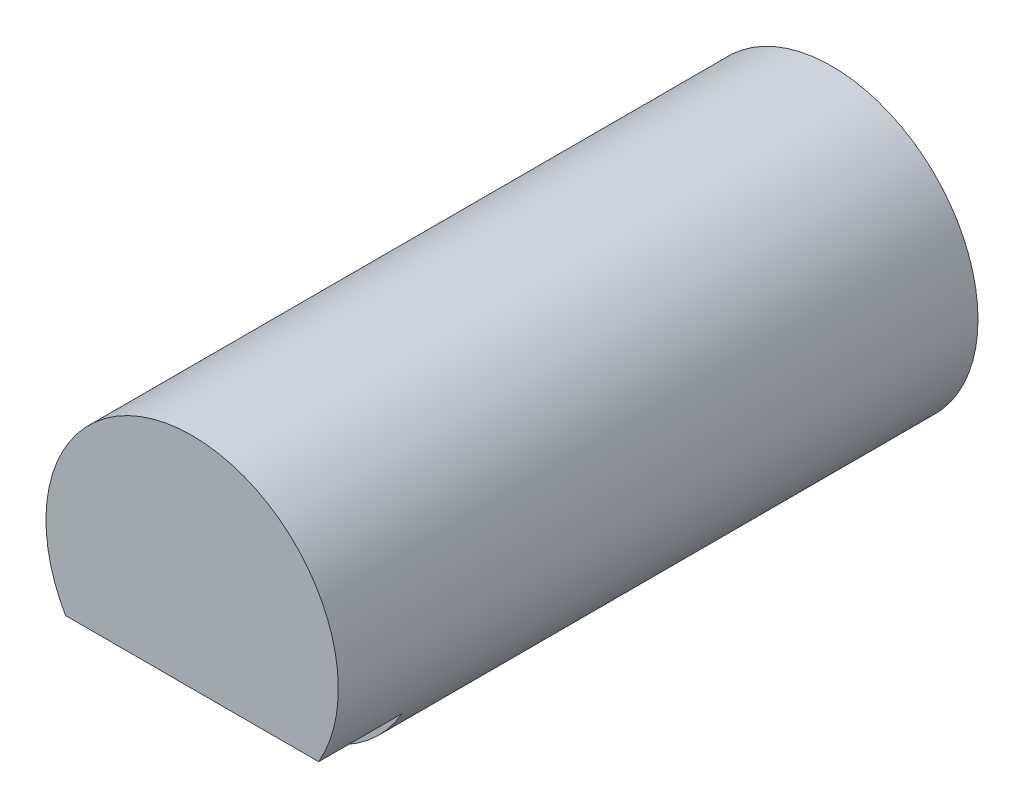
ISO-10303-21;
HEADER;
FILE_DESCRIPTION(('STEP AP214'),'2;1');
FILE_NAME('part.step','',(''),(''),'','','');
FILE_SCHEMA(('AUTOMOTIVE_DESIGN { 1 0 10303 214 1 1 1 1 }'));
ENDSEC;
DATA;
#1=APPLICATION_CONTEXT('core data for automotive mechanical design processes');
#2=APPLICATION_PROTOCOL_DEFINITION('international standard','automotive_design',2000,#1);
#3=PRODUCT_CONTEXT('',#1,'mechanical');
#4=PRODUCT('Part','Part','',(#3));
#5=PRODUCT_RELATED_PRODUCT_CATEGORY('part','',(#4));
#6=PRODUCT_DEFINITION_FORMATION('','',#4);
#7=PRODUCT_DEFINITION_CONTEXT('part definition',#1,'design');
#8=PRODUCT_DEFINITION('design','',#6,#7);
#9=PRODUCT_DEFINITION_SHAPE('','',#8);
#10=(LENGTH_UNIT() NAMED_UNIT(*) SI_UNIT(.MILLI.,.METRE.));
#11=(NAMED_UNIT(*) PLANE_ANGLE_UNIT() SI_UNIT($,.RADIAN.));
#12=(NAMED_UNIT(*) SI_UNIT($,.STERADIAN.) SOLID_ANGLE_UNIT());
#13=UNCERTAINTY_MEASURE_WITH_UNIT(LENGTH_MEASURE(1.E-05),#10,'distance_accuracy_value','');
#14=(GEOMETRIC_REPRESENTATION_CONTEXT(3) GLOBAL_UNCERTAINTY_ASSIGNED_CONTEXT((#13)) GLOBAL_UNIT_ASSIGNED_CONTEXT((#10,
#11,#12)) REPRESENTATION_CONTEXT('',''));
#15=CARTESIAN_POINT('',(0.,0.,0.));
#16=DIRECTION('',(0.,0.,1.));
#17=DIRECTION('',(1.,0.,0.));
#18=AXIS2_PLACEMENT_3D('',#15,#16,#17);
#19=CARTESIAN_POINT('',(-166.361835022894,44.9023235191993,22.552));
#20=DIRECTION('',(0.,0.,1.));
#21=DIRECTION('',(1.,0.,0.));
#22=AXIS2_PLACEMENT_3D('',#19,#20,#21);
#23=PLANE('',#22);
#24=CARTESIAN_POINT('',(-166.361835022894,44.9023235191993,22.552));
#25=DIRECTION('',(0.,0.,1.));
#26=DIRECTION('',(1.,0.,0.));
#27=AXIS2_PLACEMENT_3D('',#24,#25,#26);
#28=CIRCLE('',#27,5.92666666666668);
#29=CARTESIAN_POINT('',(-171.49447891599,41.938990185866,22.552));
#30=VERTEX_POINT('',#29);
#31=CARTESIAN_POINT('',(-161.229191129798,41.938990185866,22.552));
#32=VERTEX_POINT('',#31);
#33=EDGE_CURVE('E11',#30,#32,#28,.T.);
#34=ORIENTED_EDGE('',*,*,#33,.T.);
#35=DIRECTION('',(-1.,0.,0.));
#36=VECTOR('',#35,1.);
#37=CARTESIAN_POINT('',(0.,41.938990185866,22.552));
#38=LINE('',#37,#36);
#39=EDGE_CURVE('E68',#32,#30,#38,.T.);
#40=ORIENTED_EDGE('',*,*,#39,.T.);
#41=EDGE_LOOP('',(#34,#40));
#42=FACE_BOUND('',#41,.T.);
#43=ADVANCED_FACE('F35',(#42),#23,.T.);
#44=CARTESIAN_POINT('',(-166.361835022894,44.9023235191993,22.552));
#45=DIRECTION('',(0.,0.,-1.));
#46=DIRECTION('',(-1.,0.,0.));
#47=AXIS2_PLACEMENT_3D('',#44,#45,#46);
#48=CYLINDRICAL_SURFACE('',#47,5.92666666666668);
#49=ORIENTED_EDGE('',*,*,#33,.F.);
#50=DIRECTION('',(0.,0.,-1.));
#51=VECTOR('',#50,1.);
#52=CARTESIAN_POINT('',(-171.49447891599,41.938990185866,25.9386666666667));
#53=LINE('',#52,#51);
#54=CARTESIAN_POINT('',(-171.49447891599,41.938990185866,25.9386666666667));
#55=VERTEX_POINT('',#54);
#56=EDGE_CURVE('E50',#55,#30,#53,.T.);
#57=ORIENTED_EDGE('',*,*,#56,.F.);
#58=CARTESIAN_POINT('',(-166.361835022894,44.9023235191993,25.9386666666667));
#59=DIRECTION('',(0.,0.,1.));
#60=DIRECTION('',(1.,0.,0.));
#61=AXIS2_PLACEMENT_3D('',#58,#59,#60);
#62=CIRCLE('',#61,5.92666666666668);
#63=CARTESIAN_POINT('',(-161.229191129798,41.938990185866,25.9386666666667));
#64=VERTEX_POINT('',#63);
#65=EDGE_CURVE('E58',#64,#55,#62,.T.);
#66=ORIENTED_EDGE('',*,*,#65,.F.);
#67=DIRECTION('',(0.,0.,-1.));
#68=VECTOR('',#67,1.);
#69=CARTESIAN_POINT('',(-161.229191129798,41.938990185866,25.9386666666667));
#70=LINE('',#69,#68);
#71=EDGE_CURVE('E65',#64,#32,#70,.T.);
#72=ORIENTED_EDGE('',*,*,#71,.T.);
#73=EDGE_LOOP('',(#49,#57,#66,#72));
#74=FACE_BOUND('',#73,.T.);
#75=CARTESIAN_POINT('',(-166.361835022894,44.9023235191993,0.));
#76=DIRECTION('',(0.,0.,1.));
#77=DIRECTION('',(1.,0.,0.));
#78=AXIS2_PLACEMENT_3D('',#75,#76,#77);
#79=CIRCLE('',#78,5.92666666666668);
#80=CARTESIAN_POINT('',(-160.435168356227,44.9023235191993,0.));
#81=VERTEX_POINT('',#80);
#82=EDGE_CURVE('E39',#81,#81,#79,.T.);
#83=ORIENTED_EDGE('',*,*,#82,.T.);
#84=EDGE_LOOP('',(#83));
#85=FACE_BOUND('',#84,.T.);
#86=ADVANCED_FACE('F37',(#74,#85),#48,.T.);
#87=CARTESIAN_POINT('',(-166.361835022894,44.9023235191993,0.));
#88=DIRECTION('',(0.,0.,1.));
#89=DIRECTION('',(1.,0.,0.));
#90=AXIS2_PLACEMENT_3D('',#87,#88,#89);
#91=PLANE('',#90);
#92=ORIENTED_EDGE('',*,*,#82,.F.);
#93=EDGE_LOOP('',(#92));
#94=FACE_BOUND('',#93,.T.);
#95=ADVANCED_FACE('F78',(#94),#91,.F.);
#96=CARTESIAN_POINT('',(0.,41.938990185866,25.9386666666667));
#97=DIRECTION('',(0.,-1.,0.));
#98=DIRECTION('',(0.,0.,-1.));
#99=AXIS2_PLACEMENT_3D('',#96,#97,#98);
#100=PLANE('',#99);
#101=ORIENTED_EDGE('',*,*,#39,.F.);
#102=ORIENTED_EDGE('',*,*,#71,.F.);
#103=DIRECTION('',(-1.,0.,0.));
#104=VECTOR('',#103,1.);
#105=CARTESIAN_POINT('',(0.,41.938990185866,25.9386666666667));
#106=LINE('',#105,#104);
#107=EDGE_CURVE('E71',#64,#55,#106,.T.);
#108=ORIENTED_EDGE('',*,*,#107,.T.);
#109=ORIENTED_EDGE('',*,*,#56,.T.);
#110=EDGE_LOOP('',(#101,#102,#108,#109));
#111=FACE_BOUND('',#110,.T.);
#112=ADVANCED_FACE('F69',(#111),#100,.T.);
#113=CARTESIAN_POINT('',(0.,0.,25.9386666666667));
#114=DIRECTION('',(0.,0.,1.));
#115=DIRECTION('',(1.,0.,0.));
#116=AXIS2_PLACEMENT_3D('',#113,#114,#115);
#117=PLANE('',#116);
#118=ORIENTED_EDGE('',*,*,#107,.F.);
#119=ORIENTED_EDGE('',*,*,#65,.T.);
#120=EDGE_LOOP('',(#118,#119));
#121=FACE_BOUND('',#120,.T.);
#122=ADVANCED_FACE('F86',(#121),#117,.T.);
#123=CLOSED_SHELL('',(#43,#86,#95,#112,#122));
#124=MANIFOLD_SOLID_BREP('B2',#123);
#125=ADVANCED_BREP_SHAPE_REPRESENTATION('',(#18,#124),#14);
#126=SHAPE_DEFINITION_REPRESENTATION(#9,#125);
ENDSEC;
END-ISO-10303-21;
